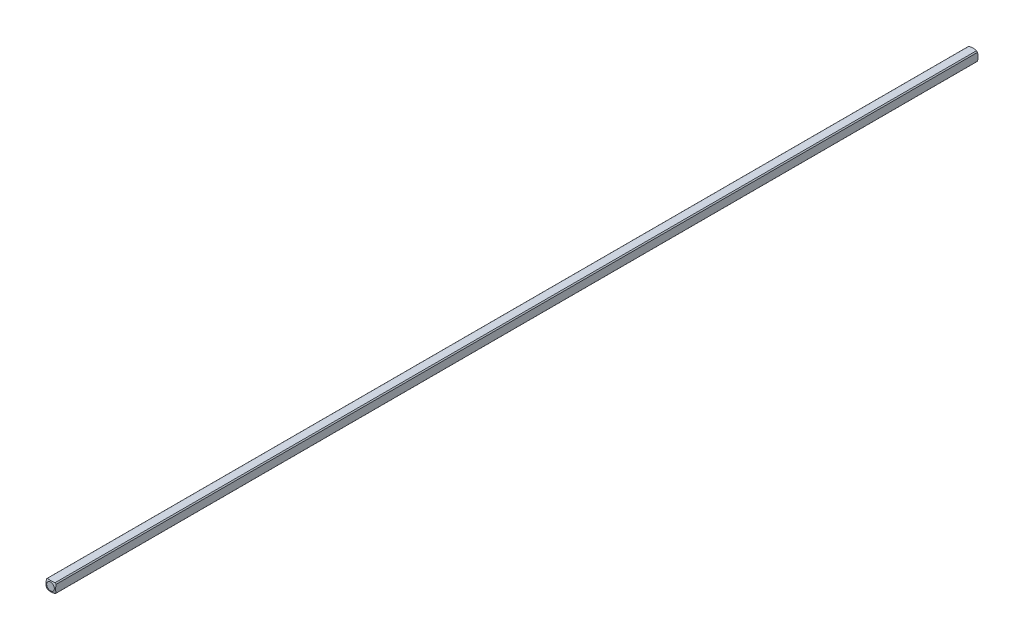
ISO-10303-21;
HEADER;
FILE_DESCRIPTION(('STEP AP214'),'2;1');
FILE_NAME('part.step','',(''),(''),'','','');
FILE_SCHEMA(('AUTOMOTIVE_DESIGN { 1 0 10303 214 1 1 1 1 }'));
ENDSEC;
DATA;
#1=APPLICATION_CONTEXT('core data for automotive mechanical design processes');
#2=APPLICATION_PROTOCOL_DEFINITION('international standard','automotive_design',2000,#1);
#3=PRODUCT_CONTEXT('',#1,'mechanical');
#4=PRODUCT('Part','Part','',(#3));
#5=PRODUCT_RELATED_PRODUCT_CATEGORY('part','',(#4));
#6=PRODUCT_DEFINITION_FORMATION('','',#4);
#7=PRODUCT_DEFINITION_CONTEXT('part definition',#1,'design');
#8=PRODUCT_DEFINITION('design','',#6,#7);
#9=PRODUCT_DEFINITION_SHAPE('','',#8);
#10=(LENGTH_UNIT() NAMED_UNIT(*) SI_UNIT(.MILLI.,.METRE.));
#11=(NAMED_UNIT(*) PLANE_ANGLE_UNIT() SI_UNIT($,.RADIAN.));
#12=(NAMED_UNIT(*) SI_UNIT($,.STERADIAN.) SOLID_ANGLE_UNIT());
#13=UNCERTAINTY_MEASURE_WITH_UNIT(LENGTH_MEASURE(1.E-05),#10,'distance_accuracy_value','');
#14=(GEOMETRIC_REPRESENTATION_CONTEXT(3) GLOBAL_UNCERTAINTY_ASSIGNED_CONTEXT((#13)) GLOBAL_UNIT_ASSIGNED_CONTEXT((#10,
#11,#12)) REPRESENTATION_CONTEXT('',''));
#15=CARTESIAN_POINT('',(0.,0.,0.));
#16=DIRECTION('',(0.,0.,1.));
#17=DIRECTION('',(1.,0.,0.));
#18=AXIS2_PLACEMENT_3D('',#15,#16,#17);
#19=CARTESIAN_POINT('',(-1.5875,-1.5875,152.4));
#20=DIRECTION('',(1.,0.,0.));
#21=DIRECTION('',(0.,0.,-1.));
#22=AXIS2_PLACEMENT_3D('',#19,#20,#21);
#23=PLANE('',#22);
#24=CARTESIAN_POINT('',(-1.5875,0.,4.91912226376204));
#25=DIRECTION('',(1.,0.,0.));
#26=DIRECTION('',(0.,0.,-1.));
#27=AXIS2_PLACEMENT_3D('',#24,#25,#26);
#28=CIRCLE('',#27,4.82558221875869);
#29=CARTESIAN_POINT('',(-1.5875,-1.26841150657032,0.263225357686905));
#30=VERTEX_POINT('',#29);
#31=CARTESIAN_POINT('',(-1.5875,1.26841150657032,0.263225357687025));
#32=VERTEX_POINT('',#31);
#33=EDGE_CURVE('E47',#30,#32,#28,.T.);
#34=ORIENTED_EDGE('',*,*,#33,.F.);
#35=DIRECTION('',(0.,0.,-1.));
#36=VECTOR('',#35,1.);
#37=CARTESIAN_POINT('',(-1.5875,-1.26841150657032,152.4));
#38=LINE('',#37,#36);
#39=CARTESIAN_POINT('',(-1.5875,-1.26841150657032,304.536774642313));
#40=VERTEX_POINT('',#39);
#41=EDGE_CURVE('E40',#40,#30,#38,.T.);
#42=ORIENTED_EDGE('',*,*,#41,.F.);
#43=CARTESIAN_POINT('',(-1.5875,0.,299.880877736238));
#44=DIRECTION('',(-1.,0.,0.));
#45=DIRECTION('',(0.,0.,1.));
#46=AXIS2_PLACEMENT_3D('',#43,#44,#45);
#47=CIRCLE('',#46,4.82558221875869);
#48=CARTESIAN_POINT('',(-1.5875,1.26841150657032,304.536774642313));
#49=VERTEX_POINT('',#48);
#50=EDGE_CURVE('E123',#40,#49,#47,.T.);
#51=ORIENTED_EDGE('',*,*,#50,.T.);
#52=DIRECTION('',(0.,0.,-1.));
#53=VECTOR('',#52,1.);
#54=CARTESIAN_POINT('',(-1.5875,1.26841150657032,152.4));
#55=LINE('',#54,#53);
#56=EDGE_CURVE('E111',#32,#49,#55,.F.);
#57=ORIENTED_EDGE('',*,*,#56,.F.);
#58=EDGE_LOOP('',(#34,#42,#51,#57));
#59=FACE_BOUND('',#58,.T.);
#60=ADVANCED_FACE('F33',(#59),#23,.F.);
#61=CARTESIAN_POINT('',(-1.5875,-1.5875,152.4));
#62=DIRECTION('',(0.,1.,0.));
#63=DIRECTION('',(0.,0.,1.));
#64=AXIS2_PLACEMENT_3D('',#61,#62,#63);
#65=PLANE('',#64);
#66=CARTESIAN_POINT('',(0.,-1.5875,4.91912226376204));
#67=DIRECTION('',(0.,1.,0.));
#68=DIRECTION('',(0.,0.,1.));
#69=AXIS2_PLACEMENT_3D('',#66,#67,#68);
#70=CIRCLE('',#69,4.82558221875869);
#71=CARTESIAN_POINT('',(1.26841150657032,-1.5875,0.263225357686905));
#72=VERTEX_POINT('',#71);
#73=CARTESIAN_POINT('',(-1.26841150657032,-1.5875,0.263225357686961));
#74=VERTEX_POINT('',#73);
#75=EDGE_CURVE('E152',#72,#74,#70,.T.);
#76=ORIENTED_EDGE('',*,*,#75,.F.);
#77=DIRECTION('',(0.,0.,-1.));
#78=VECTOR('',#77,1.);
#79=CARTESIAN_POINT('',(1.26841150657032,-1.5875,152.4));
#80=LINE('',#79,#78);
#81=CARTESIAN_POINT('',(1.26841150657032,-1.5875,304.536774642313));
#82=VERTEX_POINT('',#81);
#83=EDGE_CURVE('E165',#82,#72,#80,.T.);
#84=ORIENTED_EDGE('',*,*,#83,.F.);
#85=CARTESIAN_POINT('',(0.,-1.5875,299.880877736238));
#86=DIRECTION('',(0.,-1.,0.));
#87=DIRECTION('',(0.,0.,-1.));
#88=AXIS2_PLACEMENT_3D('',#85,#86,#87);
#89=CIRCLE('',#88,4.82558221875869);
#90=CARTESIAN_POINT('',(-1.26841150657032,-1.5875,304.536774642313));
#91=VERTEX_POINT('',#90);
#92=EDGE_CURVE('E134',#82,#91,#89,.T.);
#93=ORIENTED_EDGE('',*,*,#92,.T.);
#94=DIRECTION('',(0.,0.,-1.));
#95=VECTOR('',#94,1.);
#96=CARTESIAN_POINT('',(-1.26841150657032,-1.5875,152.4));
#97=LINE('',#96,#95);
#98=EDGE_CURVE('E163',#74,#91,#97,.F.);
#99=ORIENTED_EDGE('',*,*,#98,.F.);
#100=EDGE_LOOP('',(#76,#84,#93,#99));
#101=FACE_BOUND('',#100,.T.);
#102=ADVANCED_FACE('F175',(#101),#65,.F.);
#103=CARTESIAN_POINT('',(1.5875,-1.5875,152.4));
#104=DIRECTION('',(-1.,0.,0.));
#105=DIRECTION('',(0.,0.,1.));
#106=AXIS2_PLACEMENT_3D('',#103,#104,#105);
#107=PLANE('',#106);
#108=CARTESIAN_POINT('',(1.5875,0.,4.91912226376204));
#109=DIRECTION('',(-1.,0.,0.));
#110=DIRECTION('',(0.,0.,1.));
#111=AXIS2_PLACEMENT_3D('',#108,#109,#110);
#112=CIRCLE('',#111,4.82558221875869);
#113=CARTESIAN_POINT('',(1.5875,1.26841150657032,0.263225357686961));
#114=VERTEX_POINT('',#113);
#115=CARTESIAN_POINT('',(1.5875,-1.26841150657032,0.263225357686905));
#116=VERTEX_POINT('',#115);
#117=EDGE_CURVE('E150',#114,#116,#112,.T.);
#118=ORIENTED_EDGE('',*,*,#117,.F.);
#119=DIRECTION('',(0.,0.,-1.));
#120=VECTOR('',#119,1.);
#121=CARTESIAN_POINT('',(1.5875,1.26841150657032,152.4));
#122=LINE('',#121,#120);
#123=CARTESIAN_POINT('',(1.5875,1.26841150657032,304.536774642313));
#124=VERTEX_POINT('',#123);
#125=EDGE_CURVE('E160',#124,#114,#122,.T.);
#126=ORIENTED_EDGE('',*,*,#125,.F.);
#127=CARTESIAN_POINT('',(1.5875,0.,299.880877736238));
#128=DIRECTION('',(1.,0.,0.));
#129=DIRECTION('',(0.,0.,-1.));
#130=AXIS2_PLACEMENT_3D('',#127,#128,#129);
#131=CIRCLE('',#130,4.82558221875869);
#132=CARTESIAN_POINT('',(1.5875,-1.26841150657032,304.536774642313));
#133=VERTEX_POINT('',#132);
#134=EDGE_CURVE('E131',#124,#133,#131,.T.);
#135=ORIENTED_EDGE('',*,*,#134,.T.);
#136=DIRECTION('',(0.,0.,-1.));
#137=VECTOR('',#136,1.);
#138=CARTESIAN_POINT('',(1.5875,-1.26841150657032,152.4));
#139=LINE('',#138,#137);
#140=EDGE_CURVE('E104',#116,#133,#139,.F.);
#141=ORIENTED_EDGE('',*,*,#140,.F.);
#142=EDGE_LOOP('',(#118,#126,#135,#141));
#143=FACE_BOUND('',#142,.T.);
#144=ADVANCED_FACE('F182',(#143),#107,.F.);
#145=CARTESIAN_POINT('',(-1.5875,1.5875,152.4));
#146=DIRECTION('',(0.,-1.,0.));
#147=DIRECTION('',(0.,0.,-1.));
#148=AXIS2_PLACEMENT_3D('',#145,#146,#147);
#149=PLANE('',#148);
#150=CARTESIAN_POINT('',(0.,1.5875,4.91912226376204));
#151=DIRECTION('',(0.,-1.,0.));
#152=DIRECTION('',(0.,0.,-1.));
#153=AXIS2_PLACEMENT_3D('',#150,#151,#152);
#154=CIRCLE('',#153,4.82558221875869);
#155=CARTESIAN_POINT('',(-1.26841150657032,1.5875,0.263225357686961));
#156=VERTEX_POINT('',#155);
#157=CARTESIAN_POINT('',(1.26841150657032,1.5875,0.263225357686905));
#158=VERTEX_POINT('',#157);
#159=EDGE_CURVE('E102',#156,#158,#154,.T.);
#160=ORIENTED_EDGE('',*,*,#159,.F.);
#161=DIRECTION('',(0.,0.,-1.));
#162=VECTOR('',#161,1.);
#163=CARTESIAN_POINT('',(-1.26841150657032,1.5875,152.4));
#164=LINE('',#163,#162);
#165=CARTESIAN_POINT('',(-1.26841150657032,1.5875,304.536774642313));
#166=VERTEX_POINT('',#165);
#167=EDGE_CURVE('E96',#166,#156,#164,.T.);
#168=ORIENTED_EDGE('',*,*,#167,.F.);
#169=CARTESIAN_POINT('',(0.,1.5875,299.880877736238));
#170=DIRECTION('',(0.,1.,0.));
#171=DIRECTION('',(0.,0.,1.));
#172=AXIS2_PLACEMENT_3D('',#169,#170,#171);
#173=CIRCLE('',#172,4.82558221875869);
#174=CARTESIAN_POINT('',(1.26841150657032,1.5875,304.536774642313));
#175=VERTEX_POINT('',#174);
#176=EDGE_CURVE('E101',#166,#175,#173,.T.);
#177=ORIENTED_EDGE('',*,*,#176,.T.);
#178=DIRECTION('',(0.,0.,-1.));
#179=VECTOR('',#178,1.);
#180=CARTESIAN_POINT('',(1.26841150657032,1.5875,152.4));
#181=LINE('',#180,#179);
#182=EDGE_CURVE('E105',#158,#175,#181,.F.);
#183=ORIENTED_EDGE('',*,*,#182,.F.);
#184=EDGE_LOOP('',(#160,#168,#177,#183));
#185=FACE_BOUND('',#184,.T.);
#186=ADVANCED_FACE('F98',(#185),#149,.F.);
#187=CARTESIAN_POINT('',(0.,0.,152.4));
#188=DIRECTION('',(0.,0.,-1.));
#189=DIRECTION('',(-1.,0.,0.));
#190=AXIS2_PLACEMENT_3D('',#187,#188,#189);
#191=CYLINDRICAL_SURFACE('',#190,2.032);
#192=ORIENTED_EDGE('',*,*,#41,.T.);
#193=CARTESIAN_POINT('',(0.,0.,0.263225357686961));
#194=DIRECTION('',(0.,0.,1.));
#195=DIRECTION('',(1.,0.,0.));
#196=AXIS2_PLACEMENT_3D('',#193,#194,#195);
#197=CIRCLE('',#196,2.032);
#198=EDGE_CURVE('E147',#30,#74,#197,.T.);
#199=ORIENTED_EDGE('',*,*,#198,.T.);
#200=ORIENTED_EDGE('',*,*,#98,.T.);
#201=CARTESIAN_POINT('',(0.,0.,304.536774642313));
#202=DIRECTION('',(0.,0.,1.));
#203=DIRECTION('',(1.,0.,0.));
#204=AXIS2_PLACEMENT_3D('',#201,#202,#203);
#205=CIRCLE('',#204,2.032);
#206=EDGE_CURVE('E128',#40,#91,#205,.T.);
#207=ORIENTED_EDGE('',*,*,#206,.F.);
#208=EDGE_LOOP('',(#192,#199,#200,#207));
#209=FACE_BOUND('',#208,.T.);
#210=ADVANCED_FACE('F171',(#209),#191,.T.);
#211=ORIENTED_EDGE('',*,*,#83,.T.);
#212=CARTESIAN_POINT('',(0.,0.,0.263225357686961));
#213=DIRECTION('',(0.,0.,1.));
#214=DIRECTION('',(1.,0.,0.));
#215=AXIS2_PLACEMENT_3D('',#212,#213,#214);
#216=CIRCLE('',#215,2.032);
#217=EDGE_CURVE('E53',#72,#116,#216,.T.);
#218=ORIENTED_EDGE('',*,*,#217,.T.);
#219=ORIENTED_EDGE('',*,*,#140,.T.);
#220=CARTESIAN_POINT('',(0.,0.,304.536774642313));
#221=DIRECTION('',(0.,0.,1.));
#222=DIRECTION('',(1.,0.,0.));
#223=AXIS2_PLACEMENT_3D('',#220,#221,#222);
#224=CIRCLE('',#223,2.032);
#225=EDGE_CURVE('E137',#82,#133,#224,.T.);
#226=ORIENTED_EDGE('',*,*,#225,.F.);
#227=EDGE_LOOP('',(#211,#218,#219,#226));
#228=FACE_BOUND('',#227,.T.);
#229=ADVANCED_FACE('F178',(#228),#191,.T.);
#230=ORIENTED_EDGE('',*,*,#125,.T.);
#231=CARTESIAN_POINT('',(0.,0.,0.263225357686961));
#232=DIRECTION('',(0.,0.,1.));
#233=DIRECTION('',(1.,0.,0.));
#234=AXIS2_PLACEMENT_3D('',#231,#232,#233);
#235=CIRCLE('',#234,2.032);
#236=EDGE_CURVE('E144',#114,#158,#235,.T.);
#237=ORIENTED_EDGE('',*,*,#236,.T.);
#238=ORIENTED_EDGE('',*,*,#182,.T.);
#239=CARTESIAN_POINT('',(0.,0.,304.536774642313));
#240=DIRECTION('',(0.,0.,1.));
#241=DIRECTION('',(1.,0.,0.));
#242=AXIS2_PLACEMENT_3D('',#239,#240,#241);
#243=CIRCLE('',#242,2.032);
#244=EDGE_CURVE('E122',#124,#175,#243,.T.);
#245=ORIENTED_EDGE('',*,*,#244,.F.);
#246=EDGE_LOOP('',(#230,#237,#238,#245));
#247=FACE_BOUND('',#246,.T.);
#248=ADVANCED_FACE('F184',(#247),#191,.T.);
#249=ORIENTED_EDGE('',*,*,#167,.T.);
#250=CARTESIAN_POINT('',(0.,0.,0.263225357686961));
#251=DIRECTION('',(0.,0.,1.));
#252=DIRECTION('',(1.,0.,0.));
#253=AXIS2_PLACEMENT_3D('',#250,#251,#252);
#254=CIRCLE('',#253,2.032);
#255=EDGE_CURVE('E12',#156,#32,#254,.T.);
#256=ORIENTED_EDGE('',*,*,#255,.T.);
#257=ORIENTED_EDGE('',*,*,#56,.T.);
#258=CARTESIAN_POINT('',(0.,0.,304.536774642313));
#259=DIRECTION('',(0.,0.,1.));
#260=DIRECTION('',(1.,0.,0.));
#261=AXIS2_PLACEMENT_3D('',#258,#259,#260);
#262=CIRCLE('',#261,2.032);
#263=EDGE_CURVE('E108',#166,#49,#262,.T.);
#264=ORIENTED_EDGE('',*,*,#263,.F.);
#265=EDGE_LOOP('',(#249,#256,#257,#264));
#266=FACE_BOUND('',#265,.T.);
#267=ADVANCED_FACE('F109',(#266),#191,.T.);
#268=CARTESIAN_POINT('',(0.,0.,4.91912226376204));
#269=DIRECTION('',(0.,0.,1.));
#270=DIRECTION('',(-1.,0.,0.));
#271=AXIS2_PLACEMENT_3D('',#268,#269,#270);
#272=SPHERICAL_SURFACE('',#271,5.08);
#273=CARTESIAN_POINT('',(0.,0.,0.));
#274=DIRECTION('',(0.,0.,-1.));
#275=DIRECTION('',(-1.,0.,0.));
#276=AXIS2_PLACEMENT_3D('',#273,#274,#275);
#277=CIRCLE('',#276,1.26832020963187);
#278=CARTESIAN_POINT('',(-1.26832020963187,0.,0.));
#279=VERTEX_POINT('',#278);
#280=EDGE_CURVE('E155',#279,#279,#277,.T.);
#281=ORIENTED_EDGE('',*,*,#280,.F.);
#282=EDGE_LOOP('',(#281));
#283=FACE_BOUND('',#282,.T.);
#284=ORIENTED_EDGE('',*,*,#75,.T.);
#285=ORIENTED_EDGE('',*,*,#198,.F.);
#286=ORIENTED_EDGE('',*,*,#33,.T.);
#287=ORIENTED_EDGE('',*,*,#255,.F.);
#288=ORIENTED_EDGE('',*,*,#159,.T.);
#289=ORIENTED_EDGE('',*,*,#236,.F.);
#290=ORIENTED_EDGE('',*,*,#117,.T.);
#291=ORIENTED_EDGE('',*,*,#217,.F.);
#292=EDGE_LOOP('',(#284,#285,#286,#287,#288,#289,#290,#291));
#293=FACE_BOUND('',#292,.T.);
#294=ADVANCED_FACE('F185',(#283,#293),#272,.T.);
#295=CARTESIAN_POINT('',(0.,0.,0.));
#296=DIRECTION('',(0.,0.,-1.));
#297=DIRECTION('',(-1.,0.,0.));
#298=AXIS2_PLACEMENT_3D('',#295,#296,#297);
#299=PLANE('',#298);
#300=ORIENTED_EDGE('',*,*,#280,.T.);
#301=EDGE_LOOP('',(#300));
#302=FACE_BOUND('',#301,.T.);
#303=ADVANCED_FACE('F187',(#302),#299,.T.);
#304=CARTESIAN_POINT('',(0.,0.,299.880877736238));
#305=DIRECTION('',(0.,0.,-1.));
#306=DIRECTION('',(-1.,0.,0.));
#307=AXIS2_PLACEMENT_3D('',#304,#305,#306);
#308=SPHERICAL_SURFACE('',#307,5.08);
#309=CARTESIAN_POINT('',(0.,0.,304.8));
#310=DIRECTION('',(0.,0.,-1.));
#311=DIRECTION('',(-1.,0.,0.));
#312=AXIS2_PLACEMENT_3D('',#309,#310,#311);
#313=CIRCLE('',#312,1.26832020963187);
#314=CARTESIAN_POINT('',(-1.26832020963187,0.,304.8));
#315=VERTEX_POINT('',#314);
#316=EDGE_CURVE('E115',#315,#315,#313,.T.);
#317=ORIENTED_EDGE('',*,*,#316,.T.);
#318=EDGE_LOOP('',(#317));
#319=FACE_BOUND('',#318,.T.);
#320=ORIENTED_EDGE('',*,*,#92,.F.);
#321=ORIENTED_EDGE('',*,*,#225,.T.);
#322=ORIENTED_EDGE('',*,*,#134,.F.);
#323=ORIENTED_EDGE('',*,*,#244,.T.);
#324=ORIENTED_EDGE('',*,*,#176,.F.);
#325=ORIENTED_EDGE('',*,*,#263,.T.);
#326=ORIENTED_EDGE('',*,*,#50,.F.);
#327=ORIENTED_EDGE('',*,*,#206,.T.);
#328=EDGE_LOOP('',(#320,#321,#322,#323,#324,#325,#326,#327));
#329=FACE_BOUND('',#328,.T.);
#330=ADVANCED_FACE('F119',(#319,#329),#308,.T.);
#331=CARTESIAN_POINT('',(0.,0.,304.8));
#332=DIRECTION('',(0.,0.,1.));
#333=DIRECTION('',(-1.,0.,0.));
#334=AXIS2_PLACEMENT_3D('',#331,#332,#333);
#335=PLANE('',#334);
#336=ORIENTED_EDGE('',*,*,#316,.F.);
#337=EDGE_LOOP('',(#336));
#338=FACE_BOUND('',#337,.T.);
#339=ADVANCED_FACE('F232',(#338),#335,.T.);
#340=CLOSED_SHELL('',(#60,#102,#144,#186,#210,#229,#248,#267,#294,#303,#330,#339));
#341=MANIFOLD_SOLID_BREP('B2',#340);
#342=ADVANCED_BREP_SHAPE_REPRESENTATION('',(#18,#341),#14);
#343=SHAPE_DEFINITION_REPRESENTATION(#9,#342);
ENDSEC;
END-ISO-10303-21;
